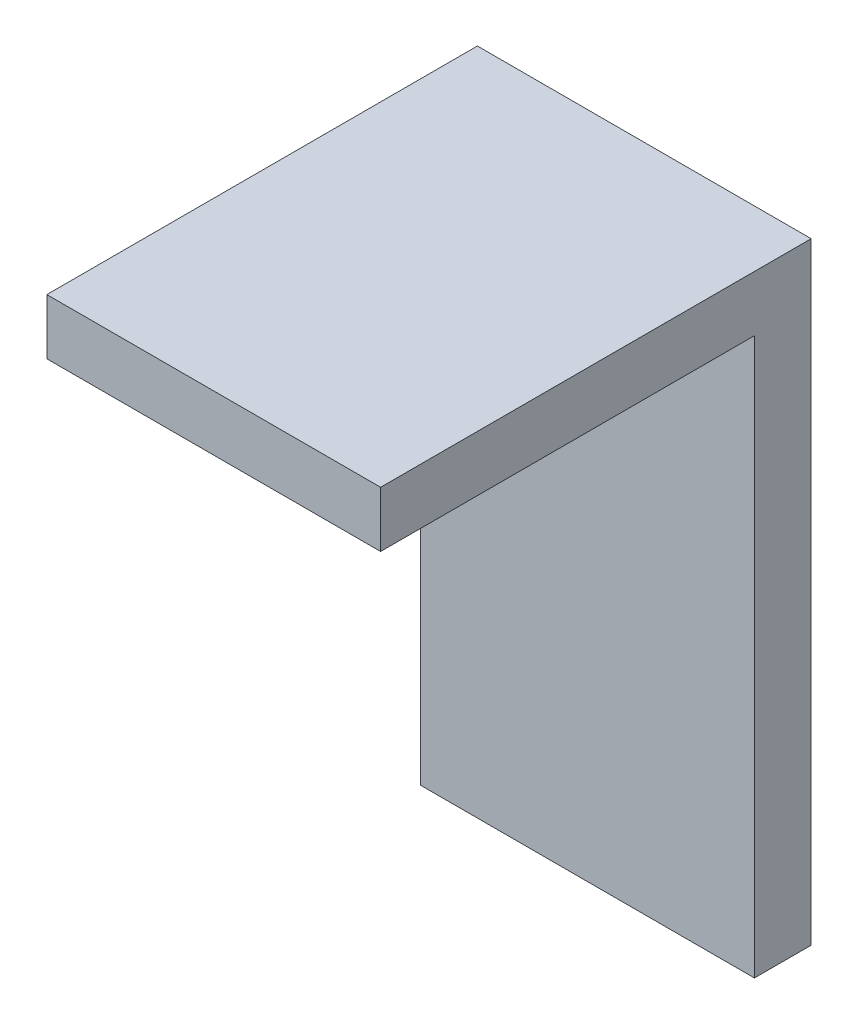
ISO-10303-21;
HEADER;
FILE_DESCRIPTION(('STEP AP214'),'2;1');
FILE_NAME('part.step','',(''),(''),'','','');
FILE_SCHEMA(('AUTOMOTIVE_DESIGN { 1 0 10303 214 1 1 1 1 }'));
ENDSEC;
DATA;
#1=APPLICATION_CONTEXT('core data for automotive mechanical design processes');
#2=APPLICATION_PROTOCOL_DEFINITION('international standard','automotive_design',2000,#1);
#3=PRODUCT_CONTEXT('',#1,'mechanical');
#4=PRODUCT('Part','Part','',(#3));
#5=PRODUCT_RELATED_PRODUCT_CATEGORY('part','',(#4));
#6=PRODUCT_DEFINITION_FORMATION('','',#4);
#7=PRODUCT_DEFINITION_CONTEXT('part definition',#1,'design');
#8=PRODUCT_DEFINITION('design','',#6,#7);
#9=PRODUCT_DEFINITION_SHAPE('','',#8);
#10=(LENGTH_UNIT() NAMED_UNIT(*) SI_UNIT(.MILLI.,.METRE.));
#11=(NAMED_UNIT(*) PLANE_ANGLE_UNIT() SI_UNIT($,.RADIAN.));
#12=(NAMED_UNIT(*) SI_UNIT($,.STERADIAN.) SOLID_ANGLE_UNIT());
#13=UNCERTAINTY_MEASURE_WITH_UNIT(LENGTH_MEASURE(1.E-05),#10,'distance_accuracy_value','');
#14=(GEOMETRIC_REPRESENTATION_CONTEXT(3) GLOBAL_UNCERTAINTY_ASSIGNED_CONTEXT((#13)) GLOBAL_UNIT_ASSIGNED_CONTEXT((#10,
#11,#12)) REPRESENTATION_CONTEXT('',''));
#15=CARTESIAN_POINT('',(0.,0.,0.));
#16=DIRECTION('',(0.,0.,1.));
#17=DIRECTION('',(1.,0.,0.));
#18=AXIS2_PLACEMENT_3D('',#15,#16,#17);
#19=CARTESIAN_POINT('',(-0.4,4.55,0.));
#20=DIRECTION('',(-1.,0.,0.));
#21=DIRECTION('',(0.,0.,1.));
#22=AXIS2_PLACEMENT_3D('',#19,#20,#21);
#23=PLANE('',#22);
#24=DIRECTION('',(0.,1.,0.));
#25=VECTOR('',#24,1.);
#26=CARTESIAN_POINT('',(-0.4,4.,0.));
#27=LINE('',#26,#25);
#28=CARTESIAN_POINT('',(-0.4,4.,0.));
#29=VERTEX_POINT('',#28);
#30=CARTESIAN_POINT('',(-0.4,4.55,0.));
#31=VERTEX_POINT('',#30);
#32=EDGE_CURVE('E11',#29,#31,#27,.T.);
#33=ORIENTED_EDGE('',*,*,#32,.F.);
#34=DIRECTION('',(0.,0.,-1.));
#35=VECTOR('',#34,1.);
#36=CARTESIAN_POINT('',(-0.4,4.,0.051));
#37=LINE('',#36,#35);
#38=CARTESIAN_POINT('',(-0.4,4.,0.051));
#39=VERTEX_POINT('',#38);
#40=EDGE_CURVE('E24',#39,#29,#37,.T.);
#41=ORIENTED_EDGE('',*,*,#40,.F.);
#42=DIRECTION('',(0.,-1.,0.));
#43=VECTOR('',#42,1.);
#44=CARTESIAN_POINT('',(-0.4,4.5,0.051));
#45=LINE('',#44,#43);
#46=CARTESIAN_POINT('',(-0.4,4.5,0.051));
#47=VERTEX_POINT('',#46);
#48=EDGE_CURVE('E87',#47,#39,#45,.T.);
#49=ORIENTED_EDGE('',*,*,#48,.F.);
#50=DIRECTION('',(0.,0.,-1.));
#51=VECTOR('',#50,1.);
#52=CARTESIAN_POINT('',(-0.4,4.5,0.387));
#53=LINE('',#52,#51);
#54=CARTESIAN_POINT('',(-0.4,4.5,0.387));
#55=VERTEX_POINT('',#54);
#56=EDGE_CURVE('E114',#55,#47,#53,.T.);
#57=ORIENTED_EDGE('',*,*,#56,.F.);
#58=DIRECTION('',(0.,-1.,0.));
#59=VECTOR('',#58,1.);
#60=CARTESIAN_POINT('',(-0.4,4.55,0.387));
#61=LINE('',#60,#59);
#62=CARTESIAN_POINT('',(-0.4,4.55,0.387));
#63=VERTEX_POINT('',#62);
#64=EDGE_CURVE('E111',#63,#55,#61,.T.);
#65=ORIENTED_EDGE('',*,*,#64,.F.);
#66=DIRECTION('',(0.,0.,1.));
#67=VECTOR('',#66,1.);
#68=CARTESIAN_POINT('',(-0.4,4.55,0.));
#69=LINE('',#68,#67);
#70=EDGE_CURVE('E108',#31,#63,#69,.T.);
#71=ORIENTED_EDGE('',*,*,#70,.F.);
#72=EDGE_LOOP('',(#33,#41,#49,#57,#65,#71));
#73=FACE_BOUND('',#72,.T.);
#74=ADVANCED_FACE('F17',(#73),#23,.T.);
#75=CARTESIAN_POINT('',(-0.1,4.,0.));
#76=DIRECTION('',(1.,0.,0.));
#77=DIRECTION('',(0.,0.,1.));
#78=AXIS2_PLACEMENT_3D('',#75,#76,#77);
#79=PLANE('',#78);
#80=DIRECTION('',(0.,-1.,0.));
#81=VECTOR('',#80,1.);
#82=CARTESIAN_POINT('',(-0.1,4.55,0.));
#83=LINE('',#82,#81);
#84=CARTESIAN_POINT('',(-0.1,4.55,0.));
#85=VERTEX_POINT('',#84);
#86=CARTESIAN_POINT('',(-0.1,4.,0.));
#87=VERTEX_POINT('',#86);
#88=EDGE_CURVE('E106',#85,#87,#83,.T.);
#89=ORIENTED_EDGE('',*,*,#88,.F.);
#90=DIRECTION('',(0.,0.,-1.));
#91=VECTOR('',#90,1.);
#92=CARTESIAN_POINT('',(-0.1,4.55,0.387));
#93=LINE('',#92,#91);
#94=CARTESIAN_POINT('',(-0.1,4.55,0.387));
#95=VERTEX_POINT('',#94);
#96=EDGE_CURVE('E103',#95,#85,#93,.T.);
#97=ORIENTED_EDGE('',*,*,#96,.F.);
#98=DIRECTION('',(0.,1.,0.));
#99=VECTOR('',#98,1.);
#100=CARTESIAN_POINT('',(-0.1,4.5,0.387));
#101=LINE('',#100,#99);
#102=CARTESIAN_POINT('',(-0.1,4.5,0.387));
#103=VERTEX_POINT('',#102);
#104=EDGE_CURVE('E100',#103,#95,#101,.T.);
#105=ORIENTED_EDGE('',*,*,#104,.F.);
#106=DIRECTION('',(0.,0.,1.));
#107=VECTOR('',#106,1.);
#108=CARTESIAN_POINT('',(-0.1,4.5,0.051));
#109=LINE('',#108,#107);
#110=CARTESIAN_POINT('',(-0.1,4.5,0.051));
#111=VERTEX_POINT('',#110);
#112=EDGE_CURVE('E72',#111,#103,#109,.T.);
#113=ORIENTED_EDGE('',*,*,#112,.F.);
#114=DIRECTION('',(0.,1.,0.));
#115=VECTOR('',#114,1.);
#116=CARTESIAN_POINT('',(-0.1,4.,0.051));
#117=LINE('',#116,#115);
#118=CARTESIAN_POINT('',(-0.1,4.,0.051));
#119=VERTEX_POINT('',#118);
#120=EDGE_CURVE('E66',#119,#111,#117,.T.);
#121=ORIENTED_EDGE('',*,*,#120,.F.);
#122=DIRECTION('',(0.,0.,1.));
#123=VECTOR('',#122,1.);
#124=CARTESIAN_POINT('',(-0.1,4.,0.));
#125=LINE('',#124,#123);
#126=EDGE_CURVE('E69',#87,#119,#125,.T.);
#127=ORIENTED_EDGE('',*,*,#126,.F.);
#128=EDGE_LOOP('',(#89,#97,#105,#113,#121,#127));
#129=FACE_BOUND('',#128,.T.);
#130=ADVANCED_FACE('F68',(#129),#79,.T.);
#131=CARTESIAN_POINT('',(-0.4,4.55,0.387));
#132=DIRECTION('',(0.,0.,1.));
#133=DIRECTION('',(0.,1.,0.));
#134=AXIS2_PLACEMENT_3D('',#131,#132,#133);
#135=PLANE('',#134);
#136=ORIENTED_EDGE('',*,*,#64,.T.);
#137=DIRECTION('',(-1.,0.,0.));
#138=VECTOR('',#137,1.);
#139=CARTESIAN_POINT('',(-0.1,4.5,0.387));
#140=LINE('',#139,#138);
#141=EDGE_CURVE('E83',#103,#55,#140,.T.);
#142=ORIENTED_EDGE('',*,*,#141,.F.);
#143=ORIENTED_EDGE('',*,*,#104,.T.);
#144=DIRECTION('',(1.,0.,0.));
#145=VECTOR('',#144,1.);
#146=CARTESIAN_POINT('',(-0.4,4.55,0.387));
#147=LINE('',#146,#145);
#148=EDGE_CURVE('E88',#63,#95,#147,.T.);
#149=ORIENTED_EDGE('',*,*,#148,.F.);
#150=EDGE_LOOP('',(#136,#142,#143,#149));
#151=FACE_BOUND('',#150,.T.);
#152=ADVANCED_FACE('F125',(#151),#135,.T.);
#153=CARTESIAN_POINT('',(-0.4,4.5,0.051));
#154=DIRECTION('',(0.,0.,1.));
#155=DIRECTION('',(0.,1.,0.));
#156=AXIS2_PLACEMENT_3D('',#153,#154,#155);
#157=PLANE('',#156);
#158=ORIENTED_EDGE('',*,*,#48,.T.);
#159=DIRECTION('',(-1.,0.,0.));
#160=VECTOR('',#159,1.);
#161=CARTESIAN_POINT('',(-0.1,4.,0.051));
#162=LINE('',#161,#160);
#163=EDGE_CURVE('E81',#119,#39,#162,.T.);
#164=ORIENTED_EDGE('',*,*,#163,.F.);
#165=ORIENTED_EDGE('',*,*,#120,.T.);
#166=DIRECTION('',(1.,0.,0.));
#167=VECTOR('',#166,1.);
#168=CARTESIAN_POINT('',(-0.4,4.5,0.051));
#169=LINE('',#168,#167);
#170=EDGE_CURVE('E89',#47,#111,#169,.T.);
#171=ORIENTED_EDGE('',*,*,#170,.F.);
#172=EDGE_LOOP('',(#158,#164,#165,#171));
#173=FACE_BOUND('',#172,.T.);
#174=ADVANCED_FACE('F86',(#173),#157,.T.);
#175=CARTESIAN_POINT('',(-0.1,4.55,0.));
#176=DIRECTION('',(0.,1.,0.));
#177=DIRECTION('',(0.,0.,1.));
#178=AXIS2_PLACEMENT_3D('',#175,#176,#177);
#179=PLANE('',#178);
#180=DIRECTION('',(1.,0.,0.));
#181=VECTOR('',#180,1.);
#182=CARTESIAN_POINT('',(-0.4,4.55,0.));
#183=LINE('',#182,#181);
#184=EDGE_CURVE('E93',#31,#85,#183,.T.);
#185=ORIENTED_EDGE('',*,*,#184,.F.);
#186=ORIENTED_EDGE('',*,*,#70,.T.);
#187=ORIENTED_EDGE('',*,*,#148,.T.);
#188=ORIENTED_EDGE('',*,*,#96,.T.);
#189=EDGE_LOOP('',(#185,#186,#187,#188));
#190=FACE_BOUND('',#189,.T.);
#191=ADVANCED_FACE('F121',(#190),#179,.T.);
#192=CARTESIAN_POINT('',(-0.4,4.,0.));
#193=DIRECTION('',(0.,-1.,0.));
#194=DIRECTION('',(0.,0.,1.));
#195=AXIS2_PLACEMENT_3D('',#192,#193,#194);
#196=PLANE('',#195);
#197=DIRECTION('',(-1.,0.,0.));
#198=VECTOR('',#197,1.);
#199=CARTESIAN_POINT('',(-0.1,4.,0.));
#200=LINE('',#199,#198);
#201=EDGE_CURVE('E82',#87,#29,#200,.T.);
#202=ORIENTED_EDGE('',*,*,#201,.F.);
#203=ORIENTED_EDGE('',*,*,#126,.T.);
#204=ORIENTED_EDGE('',*,*,#163,.T.);
#205=ORIENTED_EDGE('',*,*,#40,.T.);
#206=EDGE_LOOP('',(#202,#203,#204,#205));
#207=FACE_BOUND('',#206,.T.);
#208=ADVANCED_FACE('F80',(#207),#196,.T.);
#209=CARTESIAN_POINT('',(-0.4,4.5,0.051));
#210=DIRECTION('',(0.,-1.,0.));
#211=DIRECTION('',(0.,0.,1.));
#212=AXIS2_PLACEMENT_3D('',#209,#210,#211);
#213=PLANE('',#212);
#214=ORIENTED_EDGE('',*,*,#170,.T.);
#215=ORIENTED_EDGE('',*,*,#112,.T.);
#216=ORIENTED_EDGE('',*,*,#141,.T.);
#217=ORIENTED_EDGE('',*,*,#56,.T.);
#218=EDGE_LOOP('',(#214,#215,#216,#217));
#219=FACE_BOUND('',#218,.T.);
#220=ADVANCED_FACE('F127',(#219),#213,.T.);
#221=CARTESIAN_POINT('',(-0.1,4.55,0.));
#222=DIRECTION('',(0.,0.,-1.));
#223=DIRECTION('',(0.,1.,0.));
#224=AXIS2_PLACEMENT_3D('',#221,#222,#223);
#225=PLANE('',#224);
#226=ORIENTED_EDGE('',*,*,#88,.T.);
#227=ORIENTED_EDGE('',*,*,#201,.T.);
#228=ORIENTED_EDGE('',*,*,#32,.T.);
#229=ORIENTED_EDGE('',*,*,#184,.T.);
#230=EDGE_LOOP('',(#226,#227,#228,#229));
#231=FACE_BOUND('',#230,.T.);
#232=ADVANCED_FACE('F117',(#231),#225,.T.);
#233=CLOSED_SHELL('',(#74,#130,#152,#174,#191,#208,#220,#232));
#234=MANIFOLD_SOLID_BREP('B1',#233);
#235=ADVANCED_BREP_SHAPE_REPRESENTATION('',(#18,#234),#14);
#236=SHAPE_DEFINITION_REPRESENTATION(#9,#235);
ENDSEC;
END-ISO-10303-21;
